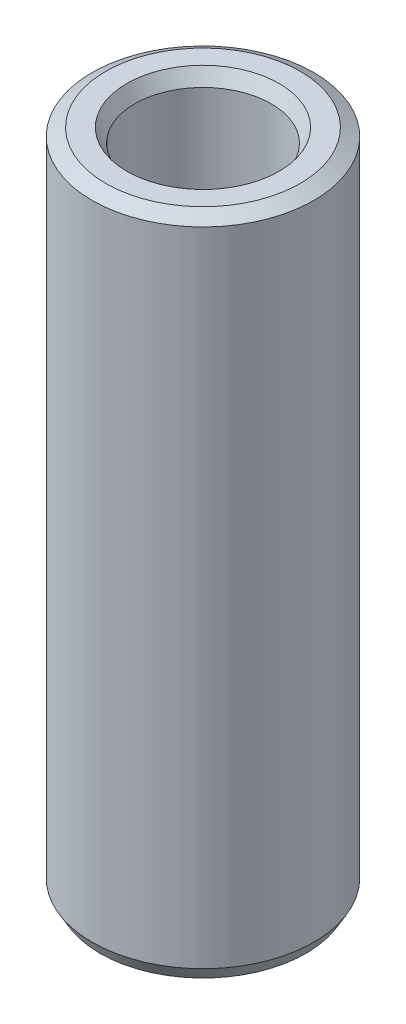
ISO-10303-21;
HEADER;
FILE_DESCRIPTION(('STEP AP214'),'2;1');
FILE_NAME('part.step','',(''),(''),'','','');
FILE_SCHEMA(('AUTOMOTIVE_DESIGN { 1 0 10303 214 1 1 1 1 }'));
ENDSEC;
DATA;
#1=APPLICATION_CONTEXT('core data for automotive mechanical design processes');
#2=APPLICATION_PROTOCOL_DEFINITION('international standard','automotive_design',2000,#1);
#3=PRODUCT_CONTEXT('',#1,'mechanical');
#4=PRODUCT('Part','Part','',(#3));
#5=PRODUCT_RELATED_PRODUCT_CATEGORY('part','',(#4));
#6=PRODUCT_DEFINITION_FORMATION('','',#4);
#7=PRODUCT_DEFINITION_CONTEXT('part definition',#1,'design');
#8=PRODUCT_DEFINITION('design','',#6,#7);
#9=PRODUCT_DEFINITION_SHAPE('','',#8);
#10=(LENGTH_UNIT() NAMED_UNIT(*) SI_UNIT(.MILLI.,.METRE.));
#11=(NAMED_UNIT(*) PLANE_ANGLE_UNIT() SI_UNIT($,.RADIAN.));
#12=(NAMED_UNIT(*) SI_UNIT($,.STERADIAN.) SOLID_ANGLE_UNIT());
#13=UNCERTAINTY_MEASURE_WITH_UNIT(LENGTH_MEASURE(1.E-05),#10,'distance_accuracy_value','');
#14=(GEOMETRIC_REPRESENTATION_CONTEXT(3) GLOBAL_UNCERTAINTY_ASSIGNED_CONTEXT((#13)) GLOBAL_UNIT_ASSIGNED_CONTEXT((#10,
#11,#12)) REPRESENTATION_CONTEXT('',''));
#15=CARTESIAN_POINT('',(0.,0.,0.));
#16=DIRECTION('',(0.,0.,1.));
#17=DIRECTION('',(1.,0.,0.));
#18=AXIS2_PLACEMENT_3D('',#15,#16,#17);
#19=CARTESIAN_POINT('',(0.,284.488386565433,0.));
#20=DIRECTION('',(0.,-1.,0.));
#21=DIRECTION('',(0.,0.,-1.));
#22=AXIS2_PLACEMENT_3D('',#19,#20,#21);
#23=CYLINDRICAL_SURFACE('',#22,47.5);
#24=CARTESIAN_POINT('',(0.,5.84808783463431,0.));
#25=DIRECTION('',(0.,1.,0.));
#26=DIRECTION('',(0.,0.,1.));
#27=AXIS2_PLACEMENT_3D('',#24,#25,#26);
#28=CIRCLE('',#27,47.5);
#29=CARTESIAN_POINT('',(0.,5.84808783463431,47.5));
#30=VERTEX_POINT('',#29);
#31=EDGE_CURVE('E10',#30,#30,#28,.T.);
#32=ORIENTED_EDGE('',*,*,#31,.T.);
#33=EDGE_LOOP('',(#32));
#34=FACE_BOUND('',#33,.T.);
#35=CARTESIAN_POINT('',(0.,281.111991479862,0.));
#36=DIRECTION('',(0.,1.,0.));
#37=DIRECTION('',(0.,0.,1.));
#38=AXIS2_PLACEMENT_3D('',#35,#36,#37);
#39=CIRCLE('',#38,47.5);
#40=CARTESIAN_POINT('',(0.,281.111991479862,-47.5000000000001));
#41=VERTEX_POINT('',#40);
#42=EDGE_CURVE('E50',#41,#41,#39,.F.);
#43=ORIENTED_EDGE('',*,*,#42,.T.);
#44=EDGE_LOOP('',(#43));
#45=FACE_BOUND('',#44,.T.);
#46=ADVANCED_FACE('F39',(#34,#45),#23,.T.);
#47=CARTESIAN_POINT('',(0.,284.488386565433,0.));
#48=DIRECTION('',(0.,1.,0.));
#49=DIRECTION('',(0.,0.,1.));
#50=AXIS2_PLACEMENT_3D('',#47,#48,#49);
#51=PLANE('',#50);
#52=CARTESIAN_POINT('',(0.,284.488386565433,0.));
#53=DIRECTION('',(0.,1.,0.));
#54=DIRECTION('',(0.,0.,1.));
#55=AXIS2_PLACEMENT_3D('',#52,#53,#54);
#56=CIRCLE('',#55,32.6219370874427);
#57=CARTESIAN_POINT('',(0.,284.488386565433,32.6219370874426));
#58=VERTEX_POINT('',#57);
#59=EDGE_CURVE('E58',#58,#58,#56,.F.);
#60=ORIENTED_EDGE('',*,*,#59,.T.);
#61=EDGE_LOOP('',(#60));
#62=FACE_BOUND('',#61,.T.);
#63=CARTESIAN_POINT('',(0.,284.488386565433,0.));
#64=DIRECTION('',(0.,1.,0.));
#65=DIRECTION('',(0.,0.,1.));
#66=AXIS2_PLACEMENT_3D('',#63,#64,#65);
#67=CIRCLE('',#66,41.6519121653655);
#68=CARTESIAN_POINT('',(0.,284.488386565433,-41.6519121653656));
#69=VERTEX_POINT('',#68);
#70=EDGE_CURVE('E61',#69,#69,#67,.T.);
#71=ORIENTED_EDGE('',*,*,#70,.T.);
#72=EDGE_LOOP('',(#71));
#73=FACE_BOUND('',#72,.T.);
#74=ADVANCED_FACE('F88',(#62,#73),#51,.T.);
#75=CARTESIAN_POINT('',(0.,0.,0.));
#76=DIRECTION('',(0.,1.,0.));
#77=DIRECTION('',(0.,0.,1.));
#78=AXIS2_PLACEMENT_3D('',#75,#76,#77);
#79=PLANE('',#78);
#80=CARTESIAN_POINT('',(0.,0.,0.));
#81=DIRECTION('',(0.,1.,0.));
#82=DIRECTION('',(0.,0.,1.));
#83=AXIS2_PLACEMENT_3D('',#80,#81,#82);
#84=CIRCLE('',#83,35.0936298365063);
#85=CARTESIAN_POINT('',(0.,0.,35.0936298365063));
#86=VERTEX_POINT('',#85);
#87=EDGE_CURVE('E51',#86,#86,#84,.T.);
#88=ORIENTED_EDGE('',*,*,#87,.T.);
#89=EDGE_LOOP('',(#88));
#90=FACE_BOUND('',#89,.T.);
#91=CARTESIAN_POINT('',(0.,0.,0.));
#92=DIRECTION('',(0.,1.,0.));
#93=DIRECTION('',(0.,0.,1.));
#94=AXIS2_PLACEMENT_3D('',#91,#92,#93);
#95=CIRCLE('',#94,44.1236049144293);
#96=CARTESIAN_POINT('',(0.,0.,44.1236049144293));
#97=VERTEX_POINT('',#96);
#98=EDGE_CURVE('E54',#97,#97,#95,.F.);
#99=ORIENTED_EDGE('',*,*,#98,.T.);
#100=EDGE_LOOP('',(#99));
#101=FACE_BOUND('',#100,.T.);
#102=ADVANCED_FACE('F83',(#90,#101),#79,.F.);
#103=CARTESIAN_POINT('',(0.,284.488386565433,0.));
#104=DIRECTION('',(0.,-1.,0.));
#105=DIRECTION('',(0.,0.,-1.));
#106=AXIS2_PLACEMENT_3D('',#103,#104,#105);
#107=CYLINDRICAL_SURFACE('',#106,29.2455420018719);
#108=CARTESIAN_POINT('',(0.,278.640298730799,0.));
#109=DIRECTION('',(0.,1.,0.));
#110=DIRECTION('',(0.,0.,1.));
#111=AXIS2_PLACEMENT_3D('',#108,#109,#110);
#112=CIRCLE('',#111,29.2455420018719);
#113=CARTESIAN_POINT('',(0.,278.640298730799,29.2455420018719));
#114=VERTEX_POINT('',#113);
#115=EDGE_CURVE('E67',#114,#114,#112,.T.);
#116=ORIENTED_EDGE('',*,*,#115,.T.);
#117=EDGE_LOOP('',(#116));
#118=FACE_BOUND('',#117,.T.);
#119=CARTESIAN_POINT('',(0.,3.3763950855708,0.));
#120=DIRECTION('',(0.,1.,0.));
#121=DIRECTION('',(0.,0.,1.));
#122=AXIS2_PLACEMENT_3D('',#119,#120,#121);
#123=CIRCLE('',#122,29.2455420018719);
#124=CARTESIAN_POINT('',(0.,3.3763950855708,29.2455420018719));
#125=VERTEX_POINT('',#124);
#126=EDGE_CURVE('E69',#125,#125,#123,.F.);
#127=ORIENTED_EDGE('',*,*,#126,.T.);
#128=EDGE_LOOP('',(#127));
#129=FACE_BOUND('',#128,.T.);
#130=ADVANCED_FACE('F71',(#118,#129),#107,.F.);
#131=CARTESIAN_POINT('',(0.,278.640298730799,0.));
#132=DIRECTION('',(0.,1.,0.));
#133=DIRECTION('',(0.,0.,1.));
#134=AXIS2_PLACEMENT_3D('',#131,#132,#133);
#135=CONICAL_SURFACE('',#134,29.2455420018719,0.523598775598305);
#136=CARTESIAN_POINT('',(0.,284.488386565433,32.6219370874426));
#137=CARTESIAN_POINT('',(0.,284.427468983823,32.5867663053013));
#138=CARTESIAN_POINT('',(0.,284.366551402212,32.5515955231599));
#139=CARTESIAN_POINT('',(0.,284.24471623899,32.4812539588772));
#140=CARTESIAN_POINT('',(0.,284.183798657379,32.4460831767358));
#141=CARTESIAN_POINT('',(0.,284.061963494158,32.3757416124531));
#142=CARTESIAN_POINT('',(0.,284.001045912547,32.3405708303117));
#143=CARTESIAN_POINT('',(0.,283.879210749326,32.270229266029));
#144=CARTESIAN_POINT('',(0.,283.818293167715,32.2350584838876));
#145=CARTESIAN_POINT('',(0.,283.696458004493,32.1647169196049));
#146=CARTESIAN_POINT('',(0.,283.635540422882,32.1295461374636));
#147=CARTESIAN_POINT('',(0.,283.513705259661,32.0592045731808));
#148=CARTESIAN_POINT('',(0.,283.45278767805,32.0240337910395));
#149=CARTESIAN_POINT('',(0.,283.330952514829,31.9536922267568));
#150=CARTESIAN_POINT('',(0.,283.270034933218,31.9185214446154));
#151=CARTESIAN_POINT('',(0.,283.148199769996,31.8481798803327));
#152=CARTESIAN_POINT('',(0.,283.087282188385,31.8130090981913));
#153=CARTESIAN_POINT('',(0.,282.965447025164,31.7426675339086));
#154=CARTESIAN_POINT('',(0.,282.904529443553,31.7074967517672));
#155=CARTESIAN_POINT('',(0.,282.782694280332,31.6371551874845));
#156=CARTESIAN_POINT('',(0.,282.721776698721,31.6019844053431));
#157=CARTESIAN_POINT('',(0.,282.599941535499,31.5316428410604));
#158=CARTESIAN_POINT('',(0.,282.539023953889,31.496472058919));
#159=CARTESIAN_POINT('',(0.,282.417188790667,31.4261304946363));
#160=CARTESIAN_POINT('',(0.,282.356271209056,31.390959712495));
#161=CARTESIAN_POINT('',(0.,282.234436045835,31.3206181482122));
#162=CARTESIAN_POINT('',(0.,282.173518464224,31.2854473660709));
#163=CARTESIAN_POINT('',(0.,282.051683301002,31.2151058017882));
#164=CARTESIAN_POINT('',(0.,281.990765719392,31.1799350196468));
#165=CARTESIAN_POINT('',(0.,281.86893055617,31.1095934553641));
#166=CARTESIAN_POINT('',(0.,281.808012974559,31.0744226732227));
#167=CARTESIAN_POINT('',(0.,281.686177811338,31.00408110894));
#168=CARTESIAN_POINT('',(0.,281.625260229727,30.9689103267986));
#169=CARTESIAN_POINT('',(0.,281.503425066505,30.8985687625159));
#170=CARTESIAN_POINT('',(0.,281.442507484895,30.8633979803745));
#171=CARTESIAN_POINT('',(0.,281.320672321673,30.7930564160918));
#172=CARTESIAN_POINT('',(0.,281.259754740062,30.7578856339504));
#173=CARTESIAN_POINT('',(0.,281.137919576841,30.6875440696677));
#174=CARTESIAN_POINT('',(0.,281.07700199523,30.6523732875263));
#175=CARTESIAN_POINT('',(0.,280.955166832008,30.5820317232436));
#176=CARTESIAN_POINT('',(0.,280.894249250398,30.5468609411023));
#177=CARTESIAN_POINT('',(0.,280.772414087176,30.4765193768195));
#178=CARTESIAN_POINT('',(0.,280.711496505565,30.4413485946782));
#179=CARTESIAN_POINT('',(0.,280.589661342344,30.3710070303955));
#180=CARTESIAN_POINT('',(0.,280.528743760733,30.3358362482541));
#181=CARTESIAN_POINT('',(0.,280.406908597511,30.2654946839714));
#182=CARTESIAN_POINT('',(0.,280.345991015901,30.23032390183));
#183=CARTESIAN_POINT('',(0.,280.224155852679,30.1599823375473));
#184=CARTESIAN_POINT('',(0.,280.163238271068,30.1248115554059));
#185=CARTESIAN_POINT('',(0.,280.041403107847,30.0544699911232));
#186=CARTESIAN_POINT('',(0.,279.980485526236,30.0192992089818));
#187=CARTESIAN_POINT('',(0.,279.858650363014,29.9489576446991));
#188=CARTESIAN_POINT('',(0.,279.797732781404,29.9137868625577));
#189=CARTESIAN_POINT('',(0.,279.675897618182,29.843445298275));
#190=CARTESIAN_POINT('',(0.,279.614980036571,29.8082745161337));
#191=CARTESIAN_POINT('',(0.,279.49314487335,29.7379329518509));
#192=CARTESIAN_POINT('',(0.,279.432227291739,29.7027621697096));
#193=CARTESIAN_POINT('',(0.,279.310392128517,29.6324206054268));
#194=CARTESIAN_POINT('',(0.,279.249474546907,29.5972498232855));
#195=CARTESIAN_POINT('',(0.,279.127639383685,29.5269082590028));
#196=CARTESIAN_POINT('',(0.,279.066721802074,29.4917374768614));
#197=CARTESIAN_POINT('',(0.,278.944886638853,29.4213959125787));
#198=CARTESIAN_POINT('',(0.,278.883969057242,29.3862251304373));
#199=CARTESIAN_POINT('',(0.,278.762133894021,29.3158835661546));
#200=CARTESIAN_POINT('',(0.,278.70121631241,29.2807127840132));
#201=CARTESIAN_POINT('',(0.,278.640298730799,29.2455420018719));
#202=B_SPLINE_CURVE_WITH_KNOTS('',3,(#136,#137,#138,#139,#140,#141,#142,#143,#144,#145,#146,
#147,#148,#149,#150,#151,#152,#153,#154,#155,#156,#157,#158,#159,#160,#161,#162,#163,#164,#165,
#166,#167,#168,#169,#170,#171,#172,#173,#174,#175,#176,#177,#178,#179,#180,#181,#182,#183,#184,
#185,#186,#187,#188,#189,#190,#191,#192,#193,#194,#195,#196,#197,#198,#199,#200,#201),
.UNSPECIFIED.,.F.,.F.,(4,2,2,2,2,2,2,2,2,2,2,2,2,2,2,2,2,2,2,2,2,2,2,2,2,2,2,2,2,2,2,2,4),(0.,
0.211024692848211,0.422049385696374,0.633074078544541,0.844098771392704,1.05512346424087,
1.26614815708903,1.47717284993724,1.68819754278541,1.89922223563357,2.11024692848173,
2.3212716213299,2.53229631417806,2.74332100702627,2.95434569987444,3.1653703927226,
3.37639508557076,3.58741977841893,3.79844447126709,4.00946916411525,4.22049385696347,
4.43151854981163,4.64254324265979,4.85356793550796,5.06459262835612,5.27561732120428,
5.48664201405249,5.69766670690066,5.90869139974882,6.11971609259699,6.33074078544515,
6.54176547829331,6.75279017114148),.UNSPECIFIED.);
#203=EDGE_CURVE('BSEAM77',#58,#114,#202,.T.);
#204=ORIENTED_EDGE('',*,*,#59,.F.);
#205=ORIENTED_EDGE('',*,*,#115,.F.);
#206=ORIENTED_EDGE('',*,*,#203,.T.);
#207=ORIENTED_EDGE('',*,*,#203,.F.);
#208=EDGE_LOOP('',(#204,#206,#205,#207));
#209=FACE_BOUND('',#208,.T.);
#210=ADVANCED_FACE('F77',(#209),#135,.F.);
#211=CARTESIAN_POINT('',(0.,0.,0.));
#212=DIRECTION('',(0.,-1.,0.));
#213=DIRECTION('',(0.,0.,-1.));
#214=AXIS2_PLACEMENT_3D('',#211,#212,#213);
#215=CONICAL_SURFACE('',#214,35.0936298365063,1.04719755119659);
#216=ORIENTED_EDGE('',*,*,#126,.F.);
#217=EDGE_LOOP('',(#216));
#218=FACE_BOUND('',#217,.T.);
#219=ORIENTED_EDGE('',*,*,#87,.F.);
#220=EDGE_LOOP('',(#219));
#221=FACE_BOUND('',#220,.T.);
#222=ADVANCED_FACE('F73',(#218,#221),#215,.F.);
#223=CARTESIAN_POINT('',(0.,5.84808783463431,0.));
#224=DIRECTION('',(0.,1.,0.));
#225=DIRECTION('',(0.,0.,1.));
#226=AXIS2_PLACEMENT_3D('',#223,#224,#225);
#227=CONICAL_SURFACE('',#226,47.5,0.523598775598301);
#228=ORIENTED_EDGE('',*,*,#98,.F.);
#229=EDGE_LOOP('',(#228));
#230=FACE_BOUND('',#229,.T.);
#231=ORIENTED_EDGE('',*,*,#31,.F.);
#232=EDGE_LOOP('',(#231));
#233=FACE_BOUND('',#232,.T.);
#234=ADVANCED_FACE('F76',(#230,#233),#227,.T.);
#235=CARTESIAN_POINT('',(0.,284.488386565433,0.));
#236=DIRECTION('',(0.,-1.,0.));
#237=DIRECTION('',(0.,0.,-1.));
#238=AXIS2_PLACEMENT_3D('',#235,#236,#237);
#239=CONICAL_SURFACE('',#238,41.6519121653655,1.04719755119659);
#240=CARTESIAN_POINT('',(0.,281.111991479862,-47.5000000000001));
#241=CARTESIAN_POINT('',(0.,281.147162262004,-47.4390824183893));
#242=CARTESIAN_POINT('',(0.,281.182333044145,-47.3781648367785));
#243=CARTESIAN_POINT('',(0.,281.252674608428,-47.256329673557));
#244=CARTESIAN_POINT('',(0.,281.287845390569,-47.1954120919462));
#245=CARTESIAN_POINT('',(0.,281.358186954852,-47.0735769287246));
#246=CARTESIAN_POINT('',(0.,281.393357736993,-47.0126593471138));
#247=CARTESIAN_POINT('',(0.,281.463699301276,-46.8908241838923));
#248=CARTESIAN_POINT('',(0.,281.498870083417,-46.8299066022815));
#249=CARTESIAN_POINT('',(0.,281.5692116477,-46.70807143906));
#250=CARTESIAN_POINT('',(0.,281.604382429842,-46.6471538574492));
#251=CARTESIAN_POINT('',(0.,281.674723994124,-46.5253186942276));
#252=CARTESIAN_POINT('',(0.,281.709894776266,-46.4644011126169));
#253=CARTESIAN_POINT('',(0.,281.780236340548,-46.3425659493953));
#254=CARTESIAN_POINT('',(0.,281.81540712269,-46.2816483677845));
#255=CARTESIAN_POINT('',(0.,281.885748686972,-46.159813204563));
#256=CARTESIAN_POINT('',(0.,281.920919469114,-46.0988956229522));
#257=CARTESIAN_POINT('',(0.,281.991261033397,-45.9770604597307));
#258=CARTESIAN_POINT('',(0.,282.026431815538,-45.9161428781199));
#259=CARTESIAN_POINT('',(0.,282.096773379821,-45.7943077148983));
#260=CARTESIAN_POINT('',(0.,282.131944161962,-45.7333901332875));
#261=CARTESIAN_POINT('',(0.,282.202285726245,-45.611554970066));
#262=CARTESIAN_POINT('',(0.,282.237456508386,-45.5506373884552));
#263=CARTESIAN_POINT('',(0.,282.307798072669,-45.4288022252337));
#264=CARTESIAN_POINT('',(0.,282.34296885481,-45.3678846436229));
#265=CARTESIAN_POINT('',(0.,282.413310419093,-45.2460494804013));
#266=CARTESIAN_POINT('',(0.,282.448481201234,-45.1851318987906));
#267=CARTESIAN_POINT('',(0.,282.518822765517,-45.063296735569));
#268=CARTESIAN_POINT('',(0.,282.553993547658,-45.0023791539582));
#269=CARTESIAN_POINT('',(0.,282.624335111941,-44.8805439907367));
#270=CARTESIAN_POINT('',(0.,282.659505894082,-44.8196264091259));
#271=CARTESIAN_POINT('',(0.,282.729847458365,-44.6977912459044));
#272=CARTESIAN_POINT('',(0.,282.765018240507,-44.6368736642936));
#273=CARTESIAN_POINT('',(0.,282.835359804789,-44.515038501072));
#274=CARTESIAN_POINT('',(0.,282.870530586931,-44.4541209194613));
#275=CARTESIAN_POINT('',(0.,282.940872151213,-44.3322857562397));
#276=CARTESIAN_POINT('',(0.,282.976042933355,-44.2713681746289));
#277=CARTESIAN_POINT('',(0.,283.046384497637,-44.1495330114074));
#278=CARTESIAN_POINT('',(0.,283.081555279779,-44.0886154297966));
#279=CARTESIAN_POINT('',(0.,283.151896844062,-43.9667802665751));
#280=CARTESIAN_POINT('',(0.,283.187067626203,-43.9058626849643));
#281=CARTESIAN_POINT('',(0.,283.257409190486,-43.7840275217427));
#282=CARTESIAN_POINT('',(0.,283.292579972627,-43.7231099401319));
#283=CARTESIAN_POINT('',(0.,283.36292153691,-43.6012747769104));
#284=CARTESIAN_POINT('',(0.,283.398092319051,-43.5403571952996));
#285=CARTESIAN_POINT('',(0.,283.468433883334,-43.4185220320781));
#286=CARTESIAN_POINT('',(0.,283.503604665475,-43.3576044504673));
#287=CARTESIAN_POINT('',(0.,283.573946229758,-43.2357692872457));
#288=CARTESIAN_POINT('',(0.,283.609117011899,-43.174851705635));
#289=CARTESIAN_POINT('',(0.,283.679458576182,-43.0530165424134));
#290=CARTESIAN_POINT('',(0.,283.714629358323,-42.9920989608026));
#291=CARTESIAN_POINT('',(0.,283.784970922606,-42.8702637975811));
#292=CARTESIAN_POINT('',(0.,283.820141704747,-42.8093462159703));
#293=CARTESIAN_POINT('',(0.,283.89048326903,-42.6875110527488));
#294=CARTESIAN_POINT('',(0.,283.925654051171,-42.626593471138));
#295=CARTESIAN_POINT('',(0.,283.995995615454,-42.5047583079164));
#296=CARTESIAN_POINT('',(0.,284.031166397596,-42.4438407263056));
#297=CARTESIAN_POINT('',(0.,284.101507961878,-42.3220055630841));
#298=CARTESIAN_POINT('',(0.,284.13667874402,-42.2610879814733));
#299=CARTESIAN_POINT('',(0.,284.207020308302,-42.1392528182518));
#300=CARTESIAN_POINT('',(0.,284.242191090444,-42.078335236641));
#301=CARTESIAN_POINT('',(0.,284.312532654727,-41.9565000734194));
#302=CARTESIAN_POINT('',(0.,284.347703436868,-41.8955824918087));
#303=CARTESIAN_POINT('',(0.,284.418045001151,-41.7737473285871));
#304=CARTESIAN_POINT('',(0.,284.453215783292,-41.7128297469763));
#305=CARTESIAN_POINT('',(0.,284.488386565433,-41.6519121653656));
#306=B_SPLINE_CURVE_WITH_KNOTS('',3,(#240,#241,#242,#243,#244,#245,#246,#247,#248,#249,#250,
#251,#252,#253,#254,#255,#256,#257,#258,#259,#260,#261,#262,#263,#264,#265,#266,#267,#268,#269,
#270,#271,#272,#273,#274,#275,#276,#277,#278,#279,#280,#281,#282,#283,#284,#285,#286,#287,#288,
#289,#290,#291,#292,#293,#294,#295,#296,#297,#298,#299,#300,#301,#302,#303,#304,#305),
.UNSPECIFIED.,.F.,.F.,(4,2,2,2,2,2,2,2,2,2,2,2,2,2,2,2,2,2,2,2,2,2,2,2,2,2,2,2,2,2,2,2,4),(0.,
0.211024692848175,0.42204938569635,0.633074078544526,0.844098771392695,1.05512346424087,
1.26614815708905,1.47717284993722,1.6881975427854,1.89922223563357,2.11024692848174,
2.32127162132992,2.53229631417809,2.74332100702627,2.95434569987444,3.16537039272262,
3.37639508557082,3.58741977841899,3.79844447126716,4.00946916411534,4.22049385696351,
4.43151854981169,4.64254324265987,4.85356793550803,5.06459262835621,5.27561732120439,
5.48664201405256,5.69766670690074,5.90869139974891,6.11971609259709,6.33074078544526,
6.54176547829343,6.75279017114163),.UNSPECIFIED.);
#307=EDGE_CURVE('BSEAM45',#41,#69,#306,.T.);
#308=ORIENTED_EDGE('',*,*,#42,.F.);
#309=ORIENTED_EDGE('',*,*,#70,.F.);
#310=ORIENTED_EDGE('',*,*,#307,.T.);
#311=ORIENTED_EDGE('',*,*,#307,.F.);
#312=EDGE_LOOP('',(#308,#310,#309,#311));
#313=FACE_BOUND('',#312,.T.);
#314=ADVANCED_FACE('F45',(#313),#239,.T.);
#315=CLOSED_SHELL('',(#46,#74,#102,#130,#210,#222,#234,#314));
#316=MANIFOLD_SOLID_BREP('B2',#315);
#317=ADVANCED_BREP_SHAPE_REPRESENTATION('',(#18,#316),#14);
#318=SHAPE_DEFINITION_REPRESENTATION(#9,#317);
ENDSEC;
END-ISO-10303-21;
